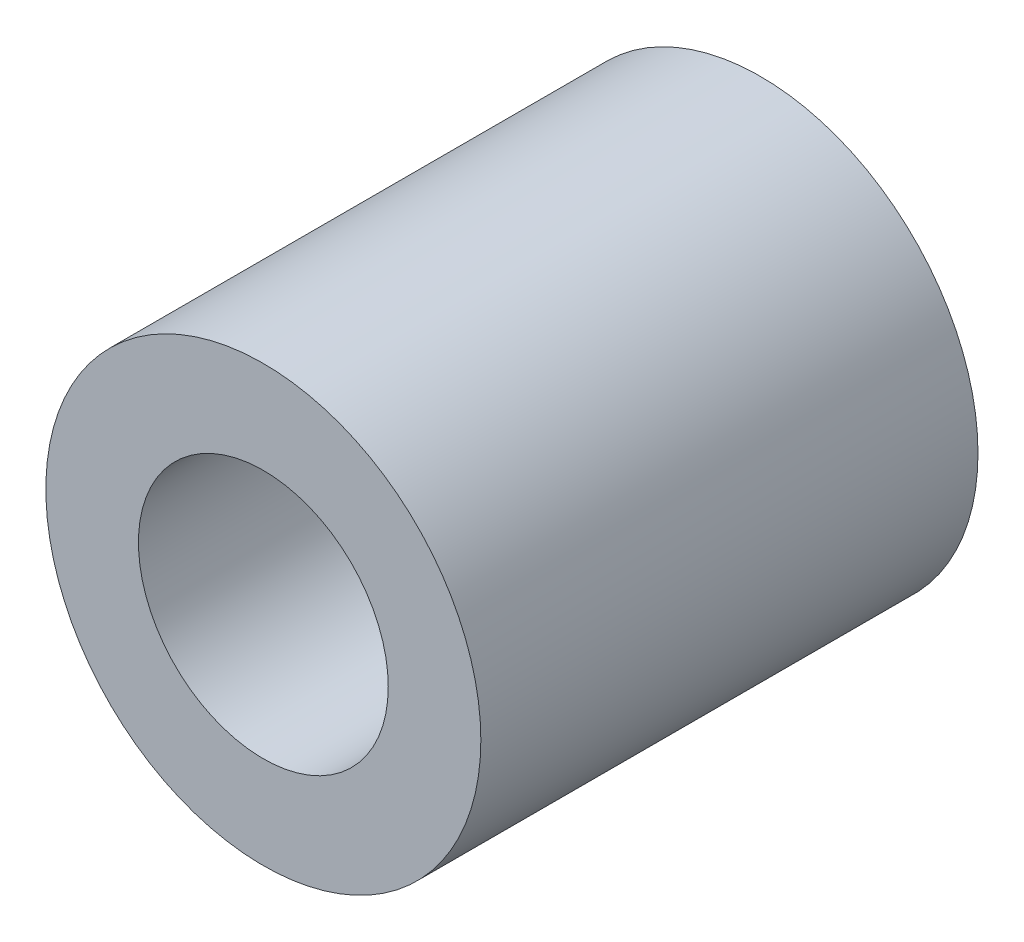
ISO-10303-21;
HEADER;
FILE_DESCRIPTION(('STEP AP214'),'2;1');
FILE_NAME('part.step','',(''),(''),'','','');
FILE_SCHEMA(('AUTOMOTIVE_DESIGN { 1 0 10303 214 1 1 1 1 }'));
ENDSEC;
DATA;
#1=APPLICATION_CONTEXT('core data for automotive mechanical design processes');
#2=APPLICATION_PROTOCOL_DEFINITION('international standard','automotive_design',2000,#1);
#3=PRODUCT_CONTEXT('',#1,'mechanical');
#4=PRODUCT('Part','Part','',(#3));
#5=PRODUCT_RELATED_PRODUCT_CATEGORY('part','',(#4));
#6=PRODUCT_DEFINITION_FORMATION('','',#4);
#7=PRODUCT_DEFINITION_CONTEXT('part definition',#1,'design');
#8=PRODUCT_DEFINITION('design','',#6,#7);
#9=PRODUCT_DEFINITION_SHAPE('','',#8);
#10=(LENGTH_UNIT() NAMED_UNIT(*) SI_UNIT(.MILLI.,.METRE.));
#11=(NAMED_UNIT(*) PLANE_ANGLE_UNIT() SI_UNIT($,.RADIAN.));
#12=(NAMED_UNIT(*) SI_UNIT($,.STERADIAN.) SOLID_ANGLE_UNIT());
#13=UNCERTAINTY_MEASURE_WITH_UNIT(LENGTH_MEASURE(1.E-05),#10,'distance_accuracy_value','');
#14=(GEOMETRIC_REPRESENTATION_CONTEXT(3) GLOBAL_UNCERTAINTY_ASSIGNED_CONTEXT((#13)) GLOBAL_UNIT_ASSIGNED_CONTEXT((#10,
#11,#12)) REPRESENTATION_CONTEXT('',''));
#15=CARTESIAN_POINT('',(0.,0.,0.));
#16=DIRECTION('',(0.,0.,1.));
#17=DIRECTION('',(1.,0.,0.));
#18=AXIS2_PLACEMENT_3D('',#15,#16,#17);
#19=CARTESIAN_POINT('',(0.,0.,40.));
#20=DIRECTION('',(0.,0.,1.));
#21=DIRECTION('',(1.,0.,0.));
#22=AXIS2_PLACEMENT_3D('',#19,#20,#21);
#23=PLANE('',#22);
#24=CARTESIAN_POINT('',(0.,0.,40.));
#25=DIRECTION('',(0.,0.,1.));
#26=DIRECTION('',(1.,0.,0.));
#27=AXIS2_PLACEMENT_3D('',#24,#25,#26);
#28=CIRCLE('',#27,17.5);
#29=CARTESIAN_POINT('',(17.5,0.,40.));
#30=VERTEX_POINT('',#29);
#31=EDGE_CURVE('E12',#30,#30,#28,.T.);
#32=ORIENTED_EDGE('',*,*,#31,.T.);
#33=EDGE_LOOP('',(#32));
#34=FACE_BOUND('',#33,.T.);
#35=CARTESIAN_POINT('',(0.,0.,40.));
#36=DIRECTION('',(0.,0.,1.));
#37=DIRECTION('',(1.,0.,0.));
#38=AXIS2_PLACEMENT_3D('',#35,#36,#37);
#39=CIRCLE('',#38,10.05);
#40=CARTESIAN_POINT('',(10.05,0.,40.));
#41=VERTEX_POINT('',#40);
#42=EDGE_CURVE('E52',#41,#41,#39,.T.);
#43=ORIENTED_EDGE('',*,*,#42,.F.);
#44=EDGE_LOOP('',(#43));
#45=FACE_BOUND('',#44,.T.);
#46=ADVANCED_FACE('F41',(#34,#45),#23,.T.);
#47=CARTESIAN_POINT('',(0.,0.,0.));
#48=DIRECTION('',(0.,0.,1.));
#49=DIRECTION('',(1.,0.,0.));
#50=AXIS2_PLACEMENT_3D('',#47,#48,#49);
#51=PLANE('',#50);
#52=CARTESIAN_POINT('',(0.,0.,0.));
#53=DIRECTION('',(0.,0.,1.));
#54=DIRECTION('',(1.,0.,0.));
#55=AXIS2_PLACEMENT_3D('',#52,#53,#54);
#56=CIRCLE('',#55,17.5);
#57=CARTESIAN_POINT('',(17.5,0.,0.));
#58=VERTEX_POINT('',#57);
#59=EDGE_CURVE('E45',#58,#58,#56,.T.);
#60=ORIENTED_EDGE('',*,*,#59,.F.);
#61=EDGE_LOOP('',(#60));
#62=FACE_BOUND('',#61,.T.);
#63=CARTESIAN_POINT('',(0.,0.,0.));
#64=DIRECTION('',(0.,0.,1.));
#65=DIRECTION('',(1.,0.,0.));
#66=AXIS2_PLACEMENT_3D('',#63,#64,#65);
#67=CIRCLE('',#66,10.05);
#68=CARTESIAN_POINT('',(10.05,0.,0.));
#69=VERTEX_POINT('',#68);
#70=EDGE_CURVE('E54',#69,#69,#67,.T.);
#71=ORIENTED_EDGE('',*,*,#70,.T.);
#72=EDGE_LOOP('',(#71));
#73=FACE_BOUND('',#72,.T.);
#74=ADVANCED_FACE('F64',(#62,#73),#51,.F.);
#75=CARTESIAN_POINT('',(0.,0.,40.));
#76=DIRECTION('',(0.,0.,-1.));
#77=DIRECTION('',(-1.,0.,0.));
#78=AXIS2_PLACEMENT_3D('',#75,#76,#77);
#79=CYLINDRICAL_SURFACE('',#78,17.5);
#80=ORIENTED_EDGE('',*,*,#31,.F.);
#81=EDGE_LOOP('',(#80));
#82=FACE_BOUND('',#81,.T.);
#83=ORIENTED_EDGE('',*,*,#59,.T.);
#84=EDGE_LOOP('',(#83));
#85=FACE_BOUND('',#84,.T.);
#86=ADVANCED_FACE('F43',(#82,#85),#79,.T.);
#87=CARTESIAN_POINT('',(0.,0.,40.));
#88=DIRECTION('',(0.,0.,-1.));
#89=DIRECTION('',(-1.,0.,0.));
#90=AXIS2_PLACEMENT_3D('',#87,#88,#89);
#91=CYLINDRICAL_SURFACE('',#90,10.05);
#92=ORIENTED_EDGE('',*,*,#42,.T.);
#93=EDGE_LOOP('',(#92));
#94=FACE_BOUND('',#93,.T.);
#95=ORIENTED_EDGE('',*,*,#70,.F.);
#96=EDGE_LOOP('',(#95));
#97=FACE_BOUND('',#96,.T.);
#98=ADVANCED_FACE('F60',(#94,#97),#91,.F.);
#99=CLOSED_SHELL('',(#46,#74,#86,#98));
#100=MANIFOLD_SOLID_BREP('B2',#99);
#101=ADVANCED_BREP_SHAPE_REPRESENTATION('',(#18,#100),#14);
#102=SHAPE_DEFINITION_REPRESENTATION(#9,#101);
ENDSEC;
END-ISO-10303-21;
